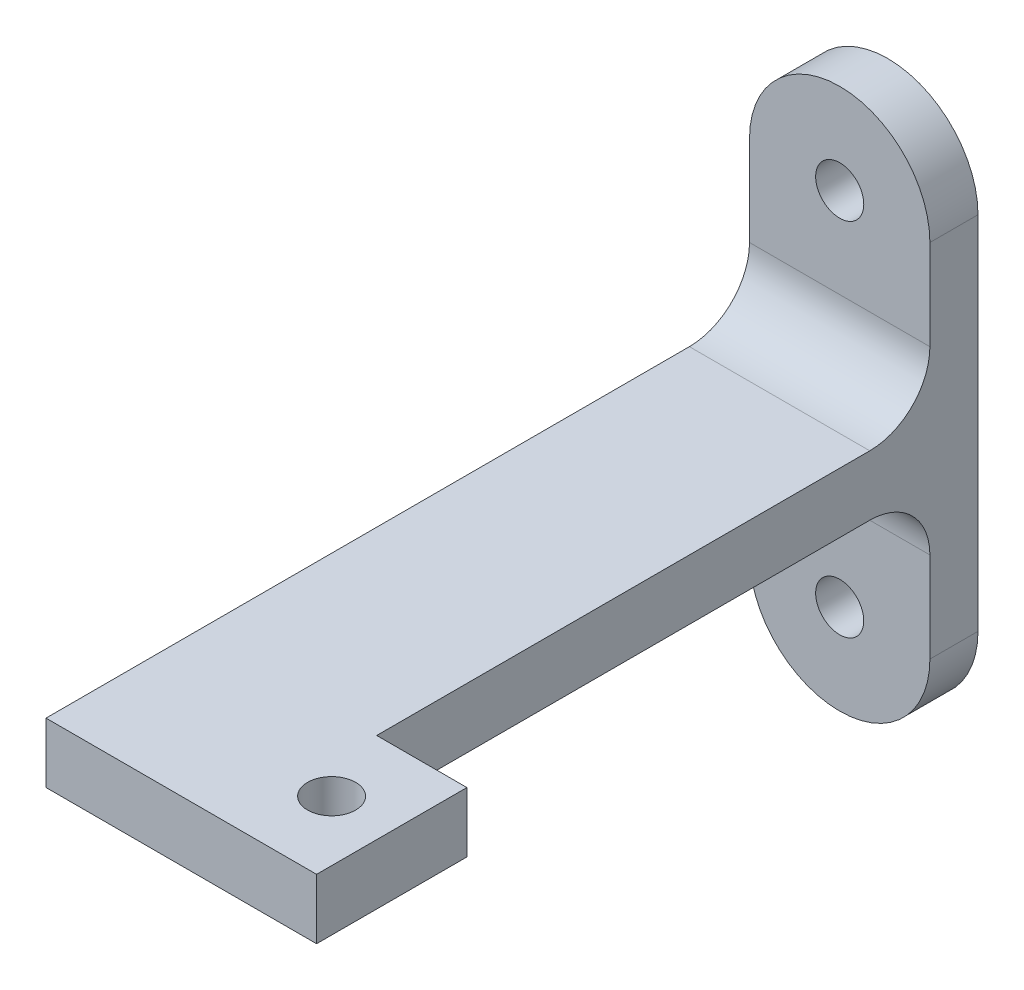
ISO-10303-21;
HEADER;
FILE_DESCRIPTION(('STEP AP214'),'2;1');
FILE_NAME('part.step','',(''),(''),'','','');
FILE_SCHEMA(('AUTOMOTIVE_DESIGN { 1 0 10303 214 1 1 1 1 }'));
ENDSEC;
DATA;
#1=APPLICATION_CONTEXT('core data for automotive mechanical design processes');
#2=APPLICATION_PROTOCOL_DEFINITION('international standard','automotive_design',2000,#1);
#3=PRODUCT_CONTEXT('',#1,'mechanical');
#4=PRODUCT('Part','Part','',(#3));
#5=PRODUCT_RELATED_PRODUCT_CATEGORY('part','',(#4));
#6=PRODUCT_DEFINITION_FORMATION('','',#4);
#7=PRODUCT_DEFINITION_CONTEXT('part definition',#1,'design');
#8=PRODUCT_DEFINITION('design','',#6,#7);
#9=PRODUCT_DEFINITION_SHAPE('','',#8);
#10=(LENGTH_UNIT() NAMED_UNIT(*) SI_UNIT(.MILLI.,.METRE.));
#11=(NAMED_UNIT(*) PLANE_ANGLE_UNIT() SI_UNIT($,.RADIAN.));
#12=(NAMED_UNIT(*) SI_UNIT($,.STERADIAN.) SOLID_ANGLE_UNIT());
#13=UNCERTAINTY_MEASURE_WITH_UNIT(LENGTH_MEASURE(1.E-05),#10,'distance_accuracy_value','');
#14=(GEOMETRIC_REPRESENTATION_CONTEXT(3) GLOBAL_UNCERTAINTY_ASSIGNED_CONTEXT((#13)) GLOBAL_UNIT_ASSIGNED_CONTEXT((#10,
#11,#12)) REPRESENTATION_CONTEXT('',''));
#15=CARTESIAN_POINT('',(0.,0.,0.));
#16=DIRECTION('',(0.,0.,1.));
#17=DIRECTION('',(1.,0.,0.));
#18=AXIS2_PLACEMENT_3D('',#15,#16,#17);
#19=CARTESIAN_POINT('',(0.,30.,8.));
#20=DIRECTION('',(0.,0.,1.));
#21=DIRECTION('',(1.,0.,0.));
#22=AXIS2_PLACEMENT_3D('',#19,#20,#21);
#23=PLANE('',#22);
#24=CARTESIAN_POINT('',(0.,30.,8.));
#25=DIRECTION('',(0.,0.,1.));
#26=DIRECTION('',(1.,0.,0.));
#27=AXIS2_PLACEMENT_3D('',#24,#25,#26);
#28=CIRCLE('',#27,4.);
#29=CARTESIAN_POINT('',(3.99999999999999,30.,8.));
#30=VERTEX_POINT('',#29);
#31=EDGE_CURVE('E191',#30,#30,#28,.T.);
#32=ORIENTED_EDGE('',*,*,#31,.F.);
#33=EDGE_LOOP('',(#32));
#34=FACE_BOUND('',#33,.T.);
#35=DIRECTION('',(0.,-1.,0.));
#36=VECTOR('',#35,1.);
#37=CARTESIAN_POINT('',(-15.,30.,8.));
#38=LINE('',#37,#36);
#39=CARTESIAN_POINT('',(-15.,30.,8.));
#40=VERTEX_POINT('',#39);
#41=CARTESIAN_POINT('',(-15.,15.,8.));
#42=VERTEX_POINT('',#41);
#43=EDGE_CURVE('E213',#40,#42,#38,.T.);
#44=ORIENTED_EDGE('',*,*,#43,.T.);
#45=DIRECTION('',(1.,0.,0.));
#46=VECTOR('',#45,1.);
#47=CARTESIAN_POINT('',(0.,15.,8.));
#48=LINE('',#47,#46);
#49=CARTESIAN_POINT('',(15.,15.,8.));
#50=VERTEX_POINT('',#49);
#51=EDGE_CURVE('E259',#42,#50,#48,.T.);
#52=ORIENTED_EDGE('',*,*,#51,.T.);
#53=DIRECTION('',(0.,1.,0.));
#54=VECTOR('',#53,1.);
#55=CARTESIAN_POINT('',(15.,30.,8.));
#56=LINE('',#55,#54);
#57=CARTESIAN_POINT('',(15.,30.,8.));
#58=VERTEX_POINT('',#57);
#59=EDGE_CURVE('E220',#50,#58,#56,.T.);
#60=ORIENTED_EDGE('',*,*,#59,.T.);
#61=CARTESIAN_POINT('',(0.,30.,8.));
#62=DIRECTION('',(0.,0.,1.));
#63=DIRECTION('',(1.,0.,0.));
#64=AXIS2_PLACEMENT_3D('',#61,#62,#63);
#65=CIRCLE('',#64,15.);
#66=EDGE_CURVE('E207',#58,#40,#65,.T.);
#67=ORIENTED_EDGE('',*,*,#66,.T.);
#68=EDGE_LOOP('',(#44,#52,#60,#67));
#69=FACE_BOUND('',#68,.T.);
#70=ADVANCED_FACE('F39',(#34,#69),#23,.T.);
#71=CARTESIAN_POINT('',(0.,-30.,8.));
#72=DIRECTION('',(0.,0.,1.));
#73=DIRECTION('',(1.,0.,0.));
#74=AXIS2_PLACEMENT_3D('',#71,#72,#73);
#75=CIRCLE('',#74,4.);
#76=CARTESIAN_POINT('',(4.,-30.,8.));
#77=VERTEX_POINT('',#76);
#78=EDGE_CURVE('E199',#77,#77,#75,.T.);
#79=ORIENTED_EDGE('',*,*,#78,.F.);
#80=EDGE_LOOP('',(#79));
#81=FACE_BOUND('',#80,.T.);
#82=CARTESIAN_POINT('',(15.,-30.,8.));
#83=VERTEX_POINT('',#82);
#84=CARTESIAN_POINT('',(15.,-15.,8.));
#85=VERTEX_POINT('',#84);
#86=EDGE_CURVE('E221',#83,#85,#56,.T.);
#87=ORIENTED_EDGE('',*,*,#86,.T.);
#88=DIRECTION('',(-1.,0.,0.));
#89=VECTOR('',#88,1.);
#90=CARTESIAN_POINT('',(0.,-15.,8.));
#91=LINE('',#90,#89);
#92=CARTESIAN_POINT('',(-15.,-15.,8.));
#93=VERTEX_POINT('',#92);
#94=EDGE_CURVE('E252',#85,#93,#91,.T.);
#95=ORIENTED_EDGE('',*,*,#94,.T.);
#96=CARTESIAN_POINT('',(-15.,-30.,8.));
#97=VERTEX_POINT('',#96);
#98=EDGE_CURVE('E211',#93,#97,#38,.T.);
#99=ORIENTED_EDGE('',*,*,#98,.T.);
#100=CARTESIAN_POINT('',(0.,-30.,8.));
#101=DIRECTION('',(0.,0.,1.));
#102=DIRECTION('',(1.,0.,0.));
#103=AXIS2_PLACEMENT_3D('',#100,#101,#102);
#104=CIRCLE('',#103,15.);
#105=EDGE_CURVE('E217',#97,#83,#104,.T.);
#106=ORIENTED_EDGE('',*,*,#105,.T.);
#107=EDGE_LOOP('',(#87,#95,#99,#106));
#108=FACE_BOUND('',#107,.T.);
#109=ADVANCED_FACE('F315',(#81,#108),#23,.T.);
#110=CARTESIAN_POINT('',(0.,30.,0.));
#111=DIRECTION('',(0.,0.,1.));
#112=DIRECTION('',(1.,0.,0.));
#113=AXIS2_PLACEMENT_3D('',#110,#111,#112);
#114=PLANE('',#113);
#115=CARTESIAN_POINT('',(0.,-30.,0.));
#116=DIRECTION('',(0.,0.,1.));
#117=DIRECTION('',(1.,0.,0.));
#118=AXIS2_PLACEMENT_3D('',#115,#116,#117);
#119=CIRCLE('',#118,15.);
#120=CARTESIAN_POINT('',(-15.,-30.,0.));
#121=VERTEX_POINT('',#120);
#122=CARTESIAN_POINT('',(15.,-30.,0.));
#123=VERTEX_POINT('',#122);
#124=EDGE_CURVE('E232',#121,#123,#119,.T.);
#125=ORIENTED_EDGE('',*,*,#124,.F.);
#126=DIRECTION('',(0.,-1.,0.));
#127=VECTOR('',#126,1.);
#128=CARTESIAN_POINT('',(-15.,30.,0.));
#129=LINE('',#128,#127);
#130=CARTESIAN_POINT('',(-15.,30.,0.));
#131=VERTEX_POINT('',#130);
#132=EDGE_CURVE('E229',#131,#121,#129,.T.);
#133=ORIENTED_EDGE('',*,*,#132,.F.);
#134=CARTESIAN_POINT('',(0.,30.,0.));
#135=DIRECTION('',(0.,0.,1.));
#136=DIRECTION('',(1.,0.,0.));
#137=AXIS2_PLACEMENT_3D('',#134,#135,#136);
#138=CIRCLE('',#137,15.);
#139=CARTESIAN_POINT('',(15.,30.,0.));
#140=VERTEX_POINT('',#139);
#141=EDGE_CURVE('E203',#140,#131,#138,.T.);
#142=ORIENTED_EDGE('',*,*,#141,.F.);
#143=DIRECTION('',(0.,1.,0.));
#144=VECTOR('',#143,1.);
#145=CARTESIAN_POINT('',(15.,30.,0.));
#146=LINE('',#145,#144);
#147=EDGE_CURVE('E212',#123,#140,#146,.T.);
#148=ORIENTED_EDGE('',*,*,#147,.F.);
#149=EDGE_LOOP('',(#125,#133,#142,#148));
#150=FACE_BOUND('',#149,.T.);
#151=CARTESIAN_POINT('',(0.,-30.,0.));
#152=DIRECTION('',(0.,0.,1.));
#153=DIRECTION('',(1.,0.,0.));
#154=AXIS2_PLACEMENT_3D('',#151,#152,#153);
#155=CIRCLE('',#154,4.);
#156=CARTESIAN_POINT('',(4.,-30.,0.));
#157=VERTEX_POINT('',#156);
#158=EDGE_CURVE('E195',#157,#157,#155,.T.);
#159=ORIENTED_EDGE('',*,*,#158,.T.);
#160=EDGE_LOOP('',(#159));
#161=FACE_BOUND('',#160,.T.);
#162=CARTESIAN_POINT('',(0.,30.,0.));
#163=DIRECTION('',(0.,0.,1.));
#164=DIRECTION('',(1.,0.,0.));
#165=AXIS2_PLACEMENT_3D('',#162,#163,#164);
#166=CIRCLE('',#165,4.);
#167=CARTESIAN_POINT('',(3.99999999999999,30.,0.));
#168=VERTEX_POINT('',#167);
#169=EDGE_CURVE('E190',#168,#168,#166,.T.);
#170=ORIENTED_EDGE('',*,*,#169,.T.);
#171=EDGE_LOOP('',(#170));
#172=FACE_BOUND('',#171,.T.);
#173=ADVANCED_FACE('F310',(#150,#161,#172),#114,.F.);
#174=CARTESIAN_POINT('',(0.,30.,8.));
#175=DIRECTION('',(0.,0.,-1.));
#176=DIRECTION('',(-1.,0.,0.));
#177=AXIS2_PLACEMENT_3D('',#174,#175,#176);
#178=CYLINDRICAL_SURFACE('',#177,15.);
#179=ORIENTED_EDGE('',*,*,#141,.T.);
#180=DIRECTION('',(0.,0.,-1.));
#181=VECTOR('',#180,1.);
#182=CARTESIAN_POINT('',(-15.,30.,8.));
#183=LINE('',#182,#181);
#184=EDGE_CURVE('E248',#40,#131,#183,.T.);
#185=ORIENTED_EDGE('',*,*,#184,.F.);
#186=ORIENTED_EDGE('',*,*,#66,.F.);
#187=DIRECTION('',(0.,0.,-1.));
#188=VECTOR('',#187,1.);
#189=CARTESIAN_POINT('',(15.,30.,8.));
#190=LINE('',#189,#188);
#191=EDGE_CURVE('E225',#58,#140,#190,.T.);
#192=ORIENTED_EDGE('',*,*,#191,.T.);
#193=EDGE_LOOP('',(#179,#185,#186,#192));
#194=FACE_BOUND('',#193,.T.);
#195=ADVANCED_FACE('F300',(#194),#178,.T.);
#196=CARTESIAN_POINT('',(-15.,30.,8.));
#197=DIRECTION('',(1.,0.,0.));
#198=DIRECTION('',(0.,1.,0.));
#199=AXIS2_PLACEMENT_3D('',#196,#197,#198);
#200=PLANE('',#199);
#201=ORIENTED_EDGE('',*,*,#98,.F.);
#202=CARTESIAN_POINT('',(-15.,-15.,18.));
#203=DIRECTION('',(1.,0.,0.));
#204=DIRECTION('',(0.,1.,0.));
#205=AXIS2_PLACEMENT_3D('',#202,#203,#204);
#206=CIRCLE('',#205,10.);
#207=CARTESIAN_POINT('',(-15.,-5.,18.));
#208=VERTEX_POINT('',#207);
#209=EDGE_CURVE('E265',#93,#208,#206,.T.);
#210=ORIENTED_EDGE('',*,*,#209,.T.);
#211=DIRECTION('',(0.,0.,-1.));
#212=VECTOR('',#211,1.);
#213=CARTESIAN_POINT('',(-15.,-5.,100.));
#214=LINE('',#213,#212);
#215=CARTESIAN_POINT('',(-15.,-5.,125.));
#216=VERTEX_POINT('',#215);
#217=EDGE_CURVE('E136',#216,#208,#214,.T.);
#218=ORIENTED_EDGE('',*,*,#217,.F.);
#219=DIRECTION('',(0.,1.,0.));
#220=VECTOR('',#219,1.);
#221=CARTESIAN_POINT('',(-15.,-56.478150704935,125.));
#222=LINE('',#221,#220);
#223=CARTESIAN_POINT('',(-15.,5.,125.));
#224=VERTEX_POINT('',#223);
#225=EDGE_CURVE('E139',#216,#224,#222,.T.);
#226=ORIENTED_EDGE('',*,*,#225,.T.);
#227=DIRECTION('',(0.,0.,-1.));
#228=VECTOR('',#227,1.);
#229=CARTESIAN_POINT('',(-15.,5.,100.));
#230=LINE('',#229,#228);
#231=CARTESIAN_POINT('',(-15.,5.,18.));
#232=VERTEX_POINT('',#231);
#233=EDGE_CURVE('E125',#224,#232,#230,.T.);
#234=ORIENTED_EDGE('',*,*,#233,.T.);
#235=CARTESIAN_POINT('',(-15.,15.,18.));
#236=DIRECTION('',(1.,0.,0.));
#237=DIRECTION('',(0.,1.,0.));
#238=AXIS2_PLACEMENT_3D('',#235,#236,#237);
#239=CIRCLE('',#238,10.);
#240=EDGE_CURVE('E11',#232,#42,#239,.T.);
#241=ORIENTED_EDGE('',*,*,#240,.T.);
#242=ORIENTED_EDGE('',*,*,#43,.F.);
#243=ORIENTED_EDGE('',*,*,#184,.T.);
#244=ORIENTED_EDGE('',*,*,#132,.T.);
#245=DIRECTION('',(0.,0.,-1.));
#246=VECTOR('',#245,1.);
#247=CARTESIAN_POINT('',(-15.,-30.,8.));
#248=LINE('',#247,#246);
#249=EDGE_CURVE('E244',#97,#121,#248,.T.);
#250=ORIENTED_EDGE('',*,*,#249,.F.);
#251=EDGE_LOOP('',(#201,#210,#218,#226,#234,#241,#242,#243,#244,#250));
#252=FACE_BOUND('',#251,.T.);
#253=ADVANCED_FACE('F141',(#252),#200,.F.);
#254=CARTESIAN_POINT('',(0.,-30.,8.));
#255=DIRECTION('',(0.,0.,-1.));
#256=DIRECTION('',(-1.,0.,0.));
#257=AXIS2_PLACEMENT_3D('',#254,#255,#256);
#258=CYLINDRICAL_SURFACE('',#257,15.);
#259=ORIENTED_EDGE('',*,*,#124,.T.);
#260=DIRECTION('',(0.,0.,-1.));
#261=VECTOR('',#260,1.);
#262=CARTESIAN_POINT('',(15.,-30.,8.));
#263=LINE('',#262,#261);
#264=EDGE_CURVE('E240',#83,#123,#263,.T.);
#265=ORIENTED_EDGE('',*,*,#264,.F.);
#266=ORIENTED_EDGE('',*,*,#105,.F.);
#267=ORIENTED_EDGE('',*,*,#249,.T.);
#268=EDGE_LOOP('',(#259,#265,#266,#267));
#269=FACE_BOUND('',#268,.T.);
#270=ADVANCED_FACE('F307',(#269),#258,.T.);
#271=CARTESIAN_POINT('',(15.,30.,8.));
#272=DIRECTION('',(-1.,0.,0.));
#273=DIRECTION('',(0.,-1.,0.));
#274=AXIS2_PLACEMENT_3D('',#271,#272,#273);
#275=PLANE('',#274);
#276=ORIENTED_EDGE('',*,*,#147,.T.);
#277=ORIENTED_EDGE('',*,*,#191,.F.);
#278=ORIENTED_EDGE('',*,*,#59,.F.);
#279=CARTESIAN_POINT('',(15.,15.,18.));
#280=DIRECTION('',(-1.,0.,0.));
#281=DIRECTION('',(0.,-1.,0.));
#282=AXIS2_PLACEMENT_3D('',#279,#280,#281);
#283=CIRCLE('',#282,10.);
#284=CARTESIAN_POINT('',(15.,5.,18.));
#285=VERTEX_POINT('',#284);
#286=EDGE_CURVE('E48',#50,#285,#283,.T.);
#287=ORIENTED_EDGE('',*,*,#286,.T.);
#288=DIRECTION('',(0.,0.,-1.));
#289=VECTOR('',#288,1.);
#290=CARTESIAN_POINT('',(15.,5.,100.));
#291=LINE('',#290,#289);
#292=CARTESIAN_POINT('',(15.,5.,100.));
#293=VERTEX_POINT('',#292);
#294=EDGE_CURVE('E135',#293,#285,#291,.T.);
#295=ORIENTED_EDGE('',*,*,#294,.F.);
#296=DIRECTION('',(0.,1.,0.));
#297=VECTOR('',#296,1.);
#298=CARTESIAN_POINT('',(15.,-5.,100.));
#299=LINE('',#298,#297);
#300=CARTESIAN_POINT('',(15.,-5.,100.));
#301=VERTEX_POINT('',#300);
#302=EDGE_CURVE('E177',#301,#293,#299,.T.);
#303=ORIENTED_EDGE('',*,*,#302,.F.);
#304=DIRECTION('',(0.,0.,-1.));
#305=VECTOR('',#304,1.);
#306=CARTESIAN_POINT('',(15.,-5.,100.));
#307=LINE('',#306,#305);
#308=CARTESIAN_POINT('',(15.,-5.,18.));
#309=VERTEX_POINT('',#308);
#310=EDGE_CURVE('E182',#301,#309,#307,.T.);
#311=ORIENTED_EDGE('',*,*,#310,.T.);
#312=CARTESIAN_POINT('',(15.,-15.,18.));
#313=DIRECTION('',(-1.,0.,0.));
#314=DIRECTION('',(0.,-1.,0.));
#315=AXIS2_PLACEMENT_3D('',#312,#313,#314);
#316=CIRCLE('',#315,10.);
#317=EDGE_CURVE('E268',#309,#85,#316,.T.);
#318=ORIENTED_EDGE('',*,*,#317,.T.);
#319=ORIENTED_EDGE('',*,*,#86,.F.);
#320=ORIENTED_EDGE('',*,*,#264,.T.);
#321=EDGE_LOOP('',(#276,#277,#278,#287,#295,#303,#311,#318,#319,#320));
#322=FACE_BOUND('',#321,.T.);
#323=ADVANCED_FACE('F291',(#322),#275,.F.);
#324=CARTESIAN_POINT('',(0.,-30.,8.));
#325=DIRECTION('',(0.,0.,-1.));
#326=DIRECTION('',(-1.,0.,0.));
#327=AXIS2_PLACEMENT_3D('',#324,#325,#326);
#328=CYLINDRICAL_SURFACE('',#327,4.);
#329=ORIENTED_EDGE('',*,*,#78,.T.);
#330=EDGE_LOOP('',(#329));
#331=FACE_BOUND('',#330,.T.);
#332=ORIENTED_EDGE('',*,*,#158,.F.);
#333=EDGE_LOOP('',(#332));
#334=FACE_BOUND('',#333,.T.);
#335=ADVANCED_FACE('F336',(#331,#334),#328,.F.);
#336=CARTESIAN_POINT('',(0.,30.,8.));
#337=DIRECTION('',(0.,0.,-1.));
#338=DIRECTION('',(-1.,0.,0.));
#339=AXIS2_PLACEMENT_3D('',#336,#337,#338);
#340=CYLINDRICAL_SURFACE('',#339,4.);
#341=ORIENTED_EDGE('',*,*,#31,.T.);
#342=EDGE_LOOP('',(#341));
#343=FACE_BOUND('',#342,.T.);
#344=ORIENTED_EDGE('',*,*,#169,.F.);
#345=EDGE_LOOP('',(#344));
#346=FACE_BOUND('',#345,.T.);
#347=ADVANCED_FACE('F370',(#343,#346),#340,.F.);
#348=CARTESIAN_POINT('',(-15.,5.,100.));
#349=DIRECTION('',(0.,-1.,0.));
#350=DIRECTION('',(0.,0.,-1.));
#351=AXIS2_PLACEMENT_3D('',#348,#349,#350);
#352=PLANE('',#351);
#353=ORIENTED_EDGE('',*,*,#294,.T.);
#354=DIRECTION('',(1.,0.,0.));
#355=VECTOR('',#354,1.);
#356=CARTESIAN_POINT('',(-15.,5.,18.));
#357=LINE('',#356,#355);
#358=EDGE_CURVE('E61',#285,#232,#357,.F.);
#359=ORIENTED_EDGE('',*,*,#358,.T.);
#360=ORIENTED_EDGE('',*,*,#233,.F.);
#361=DIRECTION('',(1.,0.,0.));
#362=VECTOR('',#361,1.);
#363=CARTESIAN_POINT('',(-15.,5.,125.));
#364=LINE('',#363,#362);
#365=CARTESIAN_POINT('',(30.,5.,125.));
#366=VERTEX_POINT('',#365);
#367=EDGE_CURVE('E131',#224,#366,#364,.T.);
#368=ORIENTED_EDGE('',*,*,#367,.T.);
#369=DIRECTION('',(0.,0.,-1.));
#370=VECTOR('',#369,1.);
#371=CARTESIAN_POINT('',(30.,5.,100.));
#372=LINE('',#371,#370);
#373=CARTESIAN_POINT('',(30.,5.,100.));
#374=VERTEX_POINT('',#373);
#375=EDGE_CURVE('E154',#366,#374,#372,.T.);
#376=ORIENTED_EDGE('',*,*,#375,.T.);
#377=DIRECTION('',(-1.,0.,0.));
#378=VECTOR('',#377,1.);
#379=CARTESIAN_POINT('',(-15.,5.,100.));
#380=LINE('',#379,#378);
#381=EDGE_CURVE('E148',#374,#293,#380,.T.);
#382=ORIENTED_EDGE('',*,*,#381,.T.);
#383=EDGE_LOOP('',(#353,#359,#360,#368,#376,#382));
#384=FACE_BOUND('',#383,.T.);
#385=CARTESIAN_POINT('',(20.,5.,112.5));
#386=DIRECTION('',(0.,1.,0.));
#387=DIRECTION('',(0.,0.,1.));
#388=AXIS2_PLACEMENT_3D('',#385,#386,#387);
#389=CIRCLE('',#388,4.);
#390=CARTESIAN_POINT('',(20.,5.,116.5));
#391=VERTEX_POINT('',#390);
#392=EDGE_CURVE('E155',#391,#391,#389,.T.);
#393=ORIENTED_EDGE('',*,*,#392,.F.);
#394=EDGE_LOOP('',(#393));
#395=FACE_BOUND('',#394,.T.);
#396=ADVANCED_FACE('F127',(#384,#395),#352,.F.);
#397=CARTESIAN_POINT('',(-15.,-5.,100.));
#398=DIRECTION('',(0.,1.,0.));
#399=DIRECTION('',(0.,0.,1.));
#400=AXIS2_PLACEMENT_3D('',#397,#398,#399);
#401=PLANE('',#400);
#402=ORIENTED_EDGE('',*,*,#217,.T.);
#403=DIRECTION('',(-1.,0.,0.));
#404=VECTOR('',#403,1.);
#405=CARTESIAN_POINT('',(-15.,-5.,18.));
#406=LINE('',#405,#404);
#407=EDGE_CURVE('E256',#208,#309,#406,.F.);
#408=ORIENTED_EDGE('',*,*,#407,.T.);
#409=ORIENTED_EDGE('',*,*,#310,.F.);
#410=DIRECTION('',(1.,0.,0.));
#411=VECTOR('',#410,1.);
#412=CARTESIAN_POINT('',(-15.,-5.,100.));
#413=LINE('',#412,#411);
#414=CARTESIAN_POINT('',(30.,-5.,100.));
#415=VERTEX_POINT('',#414);
#416=EDGE_CURVE('E275',#301,#415,#413,.T.);
#417=ORIENTED_EDGE('',*,*,#416,.T.);
#418=DIRECTION('',(0.,0.,1.));
#419=VECTOR('',#418,1.);
#420=CARTESIAN_POINT('',(30.,-5.,100.));
#421=LINE('',#420,#419);
#422=CARTESIAN_POINT('',(30.,-5.00000000000001,125.));
#423=VERTEX_POINT('',#422);
#424=EDGE_CURVE('E170',#415,#423,#421,.T.);
#425=ORIENTED_EDGE('',*,*,#424,.T.);
#426=DIRECTION('',(-1.,0.,0.));
#427=VECTOR('',#426,1.);
#428=CARTESIAN_POINT('',(-15.,-5.,125.));
#429=LINE('',#428,#427);
#430=EDGE_CURVE('E178',#423,#216,#429,.T.);
#431=ORIENTED_EDGE('',*,*,#430,.T.);
#432=EDGE_LOOP('',(#402,#408,#409,#417,#425,#431));
#433=FACE_BOUND('',#432,.T.);
#434=CARTESIAN_POINT('',(20.,-5.,112.5));
#435=DIRECTION('',(0.,1.,0.));
#436=DIRECTION('',(0.,0.,1.));
#437=AXIS2_PLACEMENT_3D('',#434,#435,#436);
#438=CIRCLE('',#437,4.);
#439=CARTESIAN_POINT('',(20.,-5.,116.5));
#440=VERTEX_POINT('',#439);
#441=EDGE_CURVE('E173',#440,#440,#438,.F.);
#442=ORIENTED_EDGE('',*,*,#441,.F.);
#443=EDGE_LOOP('',(#442));
#444=FACE_BOUND('',#443,.T.);
#445=ADVANCED_FACE('F281',(#433,#444),#401,.F.);
#446=CARTESIAN_POINT('',(0.,-15.,18.));
#447=DIRECTION('',(-1.,0.,0.));
#448=DIRECTION('',(0.,0.,1.));
#449=AXIS2_PLACEMENT_3D('',#446,#447,#448);
#450=CYLINDRICAL_SURFACE('',#449,10.);
#451=ORIENTED_EDGE('',*,*,#317,.F.);
#452=ORIENTED_EDGE('',*,*,#407,.F.);
#453=ORIENTED_EDGE('',*,*,#209,.F.);
#454=ORIENTED_EDGE('',*,*,#94,.F.);
#455=EDGE_LOOP('',(#451,#452,#453,#454));
#456=FACE_BOUND('',#455,.T.);
#457=ADVANCED_FACE('F317',(#456),#450,.F.);
#458=CARTESIAN_POINT('',(0.,15.,18.));
#459=DIRECTION('',(1.,0.,0.));
#460=DIRECTION('',(0.,0.,-1.));
#461=AXIS2_PLACEMENT_3D('',#458,#459,#460);
#462=CYLINDRICAL_SURFACE('',#461,10.);
#463=ORIENTED_EDGE('',*,*,#240,.F.);
#464=ORIENTED_EDGE('',*,*,#358,.F.);
#465=ORIENTED_EDGE('',*,*,#286,.F.);
#466=ORIENTED_EDGE('',*,*,#51,.F.);
#467=EDGE_LOOP('',(#463,#464,#465,#466));
#468=FACE_BOUND('',#467,.T.);
#469=ADVANCED_FACE('F41',(#468),#462,.F.);
#470=CARTESIAN_POINT('',(-15.,-56.478150704935,125.));
#471=DIRECTION('',(0.,0.,1.));
#472=DIRECTION('',(1.,0.,0.));
#473=AXIS2_PLACEMENT_3D('',#470,#471,#472);
#474=PLANE('',#473);
#475=ORIENTED_EDGE('',*,*,#430,.F.);
#476=DIRECTION('',(0.,1.,0.));
#477=VECTOR('',#476,1.);
#478=CARTESIAN_POINT('',(30.,-56.478150704935,125.));
#479=LINE('',#478,#477);
#480=EDGE_CURVE('E147',#423,#366,#479,.T.);
#481=ORIENTED_EDGE('',*,*,#480,.T.);
#482=ORIENTED_EDGE('',*,*,#367,.F.);
#483=ORIENTED_EDGE('',*,*,#225,.F.);
#484=EDGE_LOOP('',(#475,#481,#482,#483));
#485=FACE_BOUND('',#484,.T.);
#486=ADVANCED_FACE('F150',(#485),#474,.T.);
#487=CARTESIAN_POINT('',(30.,-56.478150704935,100.));
#488=DIRECTION('',(1.,0.,0.));
#489=DIRECTION('',(0.,0.,-1.));
#490=AXIS2_PLACEMENT_3D('',#487,#488,#489);
#491=PLANE('',#490);
#492=ORIENTED_EDGE('',*,*,#424,.F.);
#493=DIRECTION('',(0.,1.,0.));
#494=VECTOR('',#493,1.);
#495=CARTESIAN_POINT('',(30.,-56.478150704935,100.));
#496=LINE('',#495,#494);
#497=EDGE_CURVE('E167',#415,#374,#496,.T.);
#498=ORIENTED_EDGE('',*,*,#497,.T.);
#499=ORIENTED_EDGE('',*,*,#375,.F.);
#500=ORIENTED_EDGE('',*,*,#480,.F.);
#501=EDGE_LOOP('',(#492,#498,#499,#500));
#502=FACE_BOUND('',#501,.T.);
#503=ADVANCED_FACE('F286',(#502),#491,.T.);
#504=CARTESIAN_POINT('',(-15.,-56.478150704935,100.));
#505=DIRECTION('',(0.,0.,-1.));
#506=DIRECTION('',(-1.,0.,0.));
#507=AXIS2_PLACEMENT_3D('',#504,#505,#506);
#508=PLANE('',#507);
#509=ORIENTED_EDGE('',*,*,#416,.F.);
#510=ORIENTED_EDGE('',*,*,#302,.T.);
#511=ORIENTED_EDGE('',*,*,#381,.F.);
#512=ORIENTED_EDGE('',*,*,#497,.F.);
#513=EDGE_LOOP('',(#509,#510,#511,#512));
#514=FACE_BOUND('',#513,.T.);
#515=ADVANCED_FACE('F289',(#514),#508,.T.);
#516=CARTESIAN_POINT('',(20.,-56.478150704935,112.5));
#517=DIRECTION('',(0.,1.,0.));
#518=DIRECTION('',(0.,0.,1.));
#519=AXIS2_PLACEMENT_3D('',#516,#517,#518);
#520=CYLINDRICAL_SURFACE('',#519,4.);
#521=ORIENTED_EDGE('',*,*,#441,.T.);
#522=EDGE_LOOP('',(#521));
#523=FACE_BOUND('',#522,.T.);
#524=ORIENTED_EDGE('',*,*,#392,.T.);
#525=EDGE_LOOP('',(#524));
#526=FACE_BOUND('',#525,.T.);
#527=ADVANCED_FACE('F412',(#523,#526),#520,.F.);
#528=CLOSED_SHELL('',(#70,#109,#173,#195,#253,#270,#323,#335,#347,#396,#445,#457,#469,#486,#503,
#515,#527));
#529=MANIFOLD_SOLID_BREP('B2',#528);
#530=ADVANCED_BREP_SHAPE_REPRESENTATION('',(#18,#529),#14);
#531=SHAPE_DEFINITION_REPRESENTATION(#9,#530);
ENDSEC;
END-ISO-10303-21;
